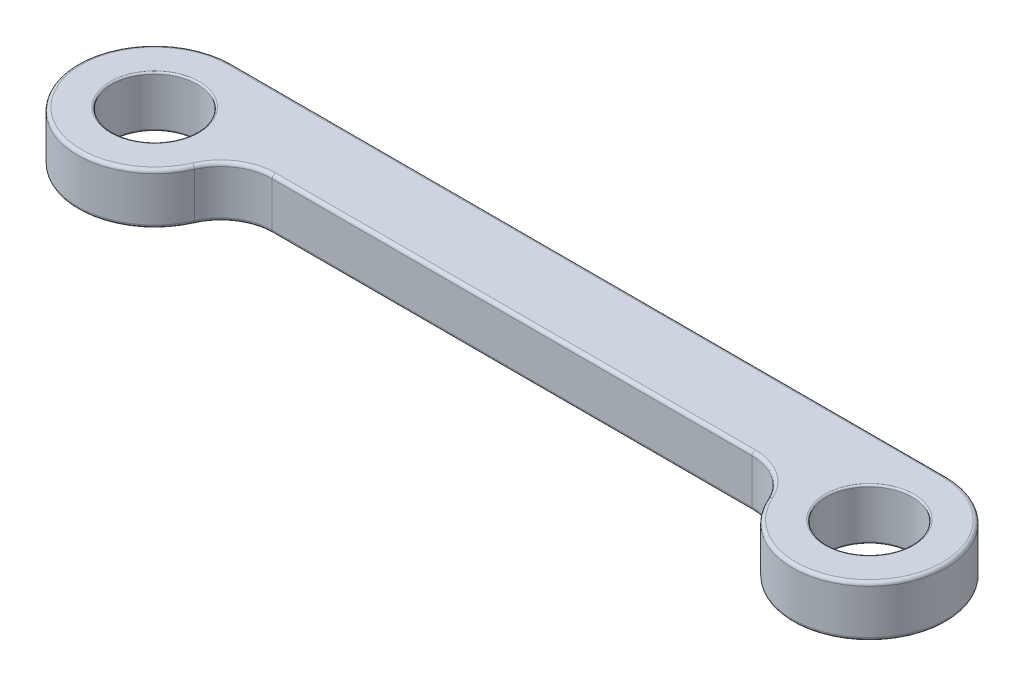
ISO-10303-21;
HEADER;
FILE_DESCRIPTION(('STEP AP214'),'2;1');
FILE_NAME('part.step','',(''),(''),'','','');
FILE_SCHEMA(('AUTOMOTIVE_DESIGN { 1 0 10303 214 1 1 1 1 }'));
ENDSEC;
DATA;
#1=APPLICATION_CONTEXT('core data for automotive mechanical design processes');
#2=APPLICATION_PROTOCOL_DEFINITION('international standard','automotive_design',2000,#1);
#3=PRODUCT_CONTEXT('',#1,'mechanical');
#4=PRODUCT('Part','Part','',(#3));
#5=PRODUCT_RELATED_PRODUCT_CATEGORY('part','',(#4));
#6=PRODUCT_DEFINITION_FORMATION('','',#4);
#7=PRODUCT_DEFINITION_CONTEXT('part definition',#1,'design');
#8=PRODUCT_DEFINITION('design','',#6,#7);
#9=PRODUCT_DEFINITION_SHAPE('','',#8);
#10=(LENGTH_UNIT() NAMED_UNIT(*) SI_UNIT(.MILLI.,.METRE.));
#11=(NAMED_UNIT(*) PLANE_ANGLE_UNIT() SI_UNIT($,.RADIAN.));
#12=(NAMED_UNIT(*) SI_UNIT($,.STERADIAN.) SOLID_ANGLE_UNIT());
#13=UNCERTAINTY_MEASURE_WITH_UNIT(LENGTH_MEASURE(1.E-05),#10,'distance_accuracy_value','');
#14=(GEOMETRIC_REPRESENTATION_CONTEXT(3) GLOBAL_UNCERTAINTY_ASSIGNED_CONTEXT((#13)) GLOBAL_UNIT_ASSIGNED_CONTEXT((#10,
#11,#12)) REPRESENTATION_CONTEXT('',''));
#15=CARTESIAN_POINT('',(0.,0.,0.));
#16=DIRECTION('',(0.,0.,1.));
#17=DIRECTION('',(1.,0.,0.));
#18=AXIS2_PLACEMENT_3D('',#15,#16,#17);
#19=CARTESIAN_POINT('',(28.0822729151325,6.,6.));
#20=DIRECTION('',(0.,1.,0.));
#21=DIRECTION('',(0.,0.,1.));
#22=AXIS2_PLACEMENT_3D('',#19,#20,#21);
#23=PLANE('',#22);
#24=CARTESIAN_POINT('',(-28.0822729151325,6.,6.));
#25=DIRECTION('',(0.,1.,0.));
#26=DIRECTION('',(0.,0.,1.));
#27=AXIS2_PLACEMENT_3D('',#24,#25,#26);
#28=CIRCLE('',#27,6.4);
#29=CARTESIAN_POINT('',(-33.9479698046759,6.,3.44));
#30=VERTEX_POINT('',#29);
#31=CARTESIAN_POINT('',(-28.0822729151325,6.,-0.4));
#32=VERTEX_POINT('',#31);
#33=EDGE_CURVE('E44',#30,#32,#28,.F.);
#34=ORIENTED_EDGE('',*,*,#33,.T.);
#35=DIRECTION('',(1.,0.,0.));
#36=VECTOR('',#35,1.);
#37=CARTESIAN_POINT('',(28.0822729151325,6.,-0.4));
#38=LINE('',#37,#36);
#39=CARTESIAN_POINT('',(28.0822729151325,6.,-0.4));
#40=VERTEX_POINT('',#39);
#41=EDGE_CURVE('E11',#32,#40,#38,.T.);
#42=ORIENTED_EDGE('',*,*,#41,.T.);
#43=CARTESIAN_POINT('',(28.0822729151325,6.,6.));
#44=DIRECTION('',(0.,1.,0.));
#45=DIRECTION('',(0.,0.,1.));
#46=AXIS2_PLACEMENT_3D('',#43,#44,#45);
#47=CIRCLE('',#46,6.4);
#48=CARTESIAN_POINT('',(33.9479698046759,6.,3.44));
#49=VERTEX_POINT('',#48);
#50=EDGE_CURVE('E199',#40,#49,#47,.F.);
#51=ORIENTED_EDGE('',*,*,#50,.T.);
#52=CARTESIAN_POINT('',(41.83,6.,0.));
#53=DIRECTION('',(0.,1.,0.));
#54=DIRECTION('',(0.,0.,1.));
#55=AXIS2_PLACEMENT_3D('',#52,#53,#54);
#56=CIRCLE('',#55,8.6);
#57=CARTESIAN_POINT('',(41.83,6.,-8.6));
#58=VERTEX_POINT('',#57);
#59=EDGE_CURVE('E201',#49,#58,#56,.T.);
#60=ORIENTED_EDGE('',*,*,#59,.T.);
#61=DIRECTION('',(-1.,0.,0.));
#62=VECTOR('',#61,1.);
#63=CARTESIAN_POINT('',(-41.83,6.,-8.6));
#64=LINE('',#63,#62);
#65=CARTESIAN_POINT('',(-41.83,6.,-8.6));
#66=VERTEX_POINT('',#65);
#67=EDGE_CURVE('E152',#58,#66,#64,.T.);
#68=ORIENTED_EDGE('',*,*,#67,.T.);
#69=CARTESIAN_POINT('',(-41.83,6.,0.));
#70=DIRECTION('',(0.,1.,0.));
#71=DIRECTION('',(0.,0.,1.));
#72=AXIS2_PLACEMENT_3D('',#69,#70,#71);
#73=CIRCLE('',#72,8.6);
#74=EDGE_CURVE('E55',#66,#30,#73,.T.);
#75=ORIENTED_EDGE('',*,*,#74,.T.);
#76=EDGE_LOOP('',(#34,#42,#51,#60,#68,#75));
#77=FACE_BOUND('',#76,.T.);
#78=CARTESIAN_POINT('',(-41.83,6.,0.));
#79=DIRECTION('',(0.,1.,0.));
#80=DIRECTION('',(0.,0.,1.));
#81=AXIS2_PLACEMENT_3D('',#78,#79,#80);
#82=CIRCLE('',#81,5.2);
#83=CARTESIAN_POINT('',(-41.83,6.,5.2));
#84=VERTEX_POINT('',#83);
#85=EDGE_CURVE('E260',#84,#84,#82,.F.);
#86=ORIENTED_EDGE('',*,*,#85,.T.);
#87=EDGE_LOOP('',(#86));
#88=FACE_BOUND('',#87,.T.);
#89=CARTESIAN_POINT('',(41.83,6.,0.));
#90=DIRECTION('',(0.,1.,0.));
#91=DIRECTION('',(0.,0.,1.));
#92=AXIS2_PLACEMENT_3D('',#89,#90,#91);
#93=CIRCLE('',#92,5.2);
#94=CARTESIAN_POINT('',(41.83,6.,5.2));
#95=VERTEX_POINT('',#94);
#96=EDGE_CURVE('E257',#95,#95,#93,.F.);
#97=ORIENTED_EDGE('',*,*,#96,.T.);
#98=EDGE_LOOP('',(#97));
#99=FACE_BOUND('',#98,.T.);
#100=ADVANCED_FACE('F35',(#77,#88,#99),#23,.T.);
#101=CARTESIAN_POINT('',(28.0822729151325,0.,6.));
#102=DIRECTION('',(0.,1.,0.));
#103=DIRECTION('',(0.,0.,1.));
#104=AXIS2_PLACEMENT_3D('',#101,#102,#103);
#105=PLANE('',#104);
#106=DIRECTION('',(-1.,0.,0.));
#107=VECTOR('',#106,1.);
#108=CARTESIAN_POINT('',(28.0822729151325,0.,-8.6));
#109=LINE('',#108,#107);
#110=CARTESIAN_POINT('',(-41.83,0.,-8.6));
#111=VERTEX_POINT('',#110);
#112=CARTESIAN_POINT('',(41.83,0.,-8.6));
#113=VERTEX_POINT('',#112);
#114=EDGE_CURVE('E177',#111,#113,#109,.F.);
#115=ORIENTED_EDGE('',*,*,#114,.T.);
#116=CARTESIAN_POINT('',(41.83,0.,0.));
#117=DIRECTION('',(0.,1.,0.));
#118=DIRECTION('',(0.,0.,1.));
#119=AXIS2_PLACEMENT_3D('',#116,#117,#118);
#120=CIRCLE('',#119,8.6);
#121=CARTESIAN_POINT('',(33.9479698046759,0.,3.44));
#122=VERTEX_POINT('',#121);
#123=EDGE_CURVE('E136',#113,#122,#120,.F.);
#124=ORIENTED_EDGE('',*,*,#123,.T.);
#125=CARTESIAN_POINT('',(28.0822729151325,0.,6.));
#126=DIRECTION('',(0.,1.,0.));
#127=DIRECTION('',(0.,0.,1.));
#128=AXIS2_PLACEMENT_3D('',#125,#126,#127);
#129=CIRCLE('',#128,6.4);
#130=CARTESIAN_POINT('',(28.0822729151325,0.,-0.4));
#131=VERTEX_POINT('',#130);
#132=EDGE_CURVE('E163',#122,#131,#129,.T.);
#133=ORIENTED_EDGE('',*,*,#132,.T.);
#134=DIRECTION('',(1.,0.,0.));
#135=VECTOR('',#134,1.);
#136=CARTESIAN_POINT('',(28.0822729151325,0.,-0.4));
#137=LINE('',#136,#135);
#138=CARTESIAN_POINT('',(-28.0822729151325,0.,-0.4));
#139=VERTEX_POINT('',#138);
#140=EDGE_CURVE('E171',#131,#139,#137,.F.);
#141=ORIENTED_EDGE('',*,*,#140,.T.);
#142=CARTESIAN_POINT('',(-28.0822729151325,0.,6.));
#143=DIRECTION('',(0.,1.,0.));
#144=DIRECTION('',(0.,0.,1.));
#145=AXIS2_PLACEMENT_3D('',#142,#143,#144);
#146=CIRCLE('',#145,6.4);
#147=CARTESIAN_POINT('',(-33.9479698046759,0.,3.44));
#148=VERTEX_POINT('',#147);
#149=EDGE_CURVE('E173',#139,#148,#146,.T.);
#150=ORIENTED_EDGE('',*,*,#149,.T.);
#151=CARTESIAN_POINT('',(-41.83,0.,0.));
#152=DIRECTION('',(0.,1.,0.));
#153=DIRECTION('',(0.,0.,1.));
#154=AXIS2_PLACEMENT_3D('',#151,#152,#153);
#155=CIRCLE('',#154,8.6);
#156=EDGE_CURVE('E175',#148,#111,#155,.F.);
#157=ORIENTED_EDGE('',*,*,#156,.T.);
#158=EDGE_LOOP('',(#115,#124,#133,#141,#150,#157));
#159=FACE_BOUND('',#158,.T.);
#160=CARTESIAN_POINT('',(-41.83,0.,0.));
#161=DIRECTION('',(0.,1.,0.));
#162=DIRECTION('',(0.,0.,1.));
#163=AXIS2_PLACEMENT_3D('',#160,#161,#162);
#164=CIRCLE('',#163,5.2);
#165=CARTESIAN_POINT('',(-41.83,0.,5.2));
#166=VERTEX_POINT('',#165);
#167=EDGE_CURVE('E161',#166,#166,#164,.T.);
#168=ORIENTED_EDGE('',*,*,#167,.T.);
#169=EDGE_LOOP('',(#168));
#170=FACE_BOUND('',#169,.T.);
#171=CARTESIAN_POINT('',(41.83,0.,0.));
#172=DIRECTION('',(0.,1.,0.));
#173=DIRECTION('',(0.,0.,1.));
#174=AXIS2_PLACEMENT_3D('',#171,#172,#173);
#175=CIRCLE('',#174,5.2);
#176=CARTESIAN_POINT('',(41.83,0.,5.2));
#177=VERTEX_POINT('',#176);
#178=EDGE_CURVE('E166',#177,#177,#175,.T.);
#179=ORIENTED_EDGE('',*,*,#178,.T.);
#180=EDGE_LOOP('',(#179));
#181=FACE_BOUND('',#180,.T.);
#182=ADVANCED_FACE('F271',(#159,#170,#181),#105,.F.);
#183=CARTESIAN_POINT('',(28.0822729151325,6.,6.));
#184=DIRECTION('',(0.,-1.,0.));
#185=DIRECTION('',(0.,0.,-1.));
#186=AXIS2_PLACEMENT_3D('',#183,#184,#185);
#187=CYLINDRICAL_SURFACE('',#186,6.);
#188=DIRECTION('',(0.,-1.,0.));
#189=VECTOR('',#188,1.);
#190=CARTESIAN_POINT('',(28.0822729151325,6.,0.));
#191=LINE('',#190,#189);
#192=CARTESIAN_POINT('',(28.0822729151325,5.6,0.));
#193=VERTEX_POINT('',#192);
#194=CARTESIAN_POINT('',(28.0822729151325,0.4,0.));
#195=VERTEX_POINT('',#194);
#196=EDGE_CURVE('E222',#193,#195,#191,.T.);
#197=ORIENTED_EDGE('',*,*,#196,.T.);
#198=CARTESIAN_POINT('',(28.0822729151325,0.4,6.));
#199=DIRECTION('',(0.,1.,0.));
#200=DIRECTION('',(0.,0.,1.));
#201=AXIS2_PLACEMENT_3D('',#198,#199,#200);
#202=CIRCLE('',#201,6.);
#203=CARTESIAN_POINT('',(33.5813637490795,0.4,3.6));
#204=VERTEX_POINT('',#203);
#205=EDGE_CURVE('E197',#195,#204,#202,.F.);
#206=ORIENTED_EDGE('',*,*,#205,.T.);
#207=DIRECTION('',(0.,-1.,0.));
#208=VECTOR('',#207,1.);
#209=CARTESIAN_POINT('',(33.5813637490795,6.,3.6));
#210=LINE('',#209,#208);
#211=CARTESIAN_POINT('',(33.5813637490795,5.6,3.6));
#212=VERTEX_POINT('',#211);
#213=EDGE_CURVE('E147',#212,#204,#210,.T.);
#214=ORIENTED_EDGE('',*,*,#213,.F.);
#215=CARTESIAN_POINT('',(28.0822729151325,5.6,6.));
#216=DIRECTION('',(0.,1.,0.));
#217=DIRECTION('',(0.,0.,1.));
#218=AXIS2_PLACEMENT_3D('',#215,#216,#217);
#219=CIRCLE('',#218,6.);
#220=EDGE_CURVE('E195',#212,#193,#219,.T.);
#221=ORIENTED_EDGE('',*,*,#220,.T.);
#222=EDGE_LOOP('',(#197,#206,#214,#221));
#223=FACE_BOUND('',#222,.T.);
#224=ADVANCED_FACE('F296',(#223),#187,.F.);
#225=CARTESIAN_POINT('',(41.83,6.,0.));
#226=DIRECTION('',(0.,-1.,0.));
#227=DIRECTION('',(0.,0.,-1.));
#228=AXIS2_PLACEMENT_3D('',#225,#226,#227);
#229=CYLINDRICAL_SURFACE('',#228,9.);
#230=ORIENTED_EDGE('',*,*,#213,.T.);
#231=CARTESIAN_POINT('',(41.83,0.4,0.));
#232=DIRECTION('',(0.,1.,0.));
#233=DIRECTION('',(0.,0.,1.));
#234=AXIS2_PLACEMENT_3D('',#231,#232,#233);
#235=CIRCLE('',#234,9.);
#236=CARTESIAN_POINT('',(41.83,0.4,-9.));
#237=VERTEX_POINT('',#236);
#238=EDGE_CURVE('E146',#204,#237,#235,.T.);
#239=ORIENTED_EDGE('',*,*,#238,.T.);
#240=DIRECTION('',(0.,-1.,0.));
#241=VECTOR('',#240,1.);
#242=CARTESIAN_POINT('',(41.83,6.,-9.));
#243=LINE('',#242,#241);
#244=CARTESIAN_POINT('',(41.83,5.6,-9.));
#245=VERTEX_POINT('',#244);
#246=EDGE_CURVE('E128',#245,#237,#243,.T.);
#247=ORIENTED_EDGE('',*,*,#246,.F.);
#248=CARTESIAN_POINT('',(41.83,5.6,0.));
#249=DIRECTION('',(0.,1.,0.));
#250=DIRECTION('',(0.,0.,1.));
#251=AXIS2_PLACEMENT_3D('',#248,#249,#250);
#252=CIRCLE('',#251,9.);
#253=EDGE_CURVE('E143',#245,#212,#252,.F.);
#254=ORIENTED_EDGE('',*,*,#253,.T.);
#255=EDGE_LOOP('',(#230,#239,#247,#254));
#256=FACE_BOUND('',#255,.T.);
#257=ADVANCED_FACE('F141',(#256),#229,.T.);
#258=CARTESIAN_POINT('',(-41.83,6.,-9.));
#259=DIRECTION('',(0.,0.,1.));
#260=DIRECTION('',(1.,0.,0.));
#261=AXIS2_PLACEMENT_3D('',#258,#259,#260);
#262=PLANE('',#261);
#263=ORIENTED_EDGE('',*,*,#246,.T.);
#264=DIRECTION('',(-1.,0.,0.));
#265=VECTOR('',#264,1.);
#266=CARTESIAN_POINT('',(-41.83,0.4,-9.));
#267=LINE('',#266,#265);
#268=CARTESIAN_POINT('',(-41.83,0.4,-9.));
#269=VERTEX_POINT('',#268);
#270=EDGE_CURVE('E135',#237,#269,#267,.T.);
#271=ORIENTED_EDGE('',*,*,#270,.T.);
#272=DIRECTION('',(0.,-1.,0.));
#273=VECTOR('',#272,1.);
#274=CARTESIAN_POINT('',(-41.83,6.,-9.));
#275=LINE('',#274,#273);
#276=CARTESIAN_POINT('',(-41.83,5.6,-9.));
#277=VERTEX_POINT('',#276);
#278=EDGE_CURVE('E130',#277,#269,#275,.T.);
#279=ORIENTED_EDGE('',*,*,#278,.F.);
#280=DIRECTION('',(-1.,0.,0.));
#281=VECTOR('',#280,1.);
#282=CARTESIAN_POINT('',(41.83,5.6,-9.));
#283=LINE('',#282,#281);
#284=EDGE_CURVE('E125',#277,#245,#283,.F.);
#285=ORIENTED_EDGE('',*,*,#284,.T.);
#286=EDGE_LOOP('',(#263,#271,#279,#285));
#287=FACE_BOUND('',#286,.T.);
#288=ADVANCED_FACE('F127',(#287),#262,.F.);
#289=CARTESIAN_POINT('',(-41.83,6.,0.));
#290=DIRECTION('',(0.,-1.,0.));
#291=DIRECTION('',(0.,0.,-1.));
#292=AXIS2_PLACEMENT_3D('',#289,#290,#291);
#293=CYLINDRICAL_SURFACE('',#292,9.);
#294=ORIENTED_EDGE('',*,*,#278,.T.);
#295=CARTESIAN_POINT('',(-41.83,0.4,0.));
#296=DIRECTION('',(0.,1.,0.));
#297=DIRECTION('',(0.,0.,1.));
#298=AXIS2_PLACEMENT_3D('',#295,#296,#297);
#299=CIRCLE('',#298,9.);
#300=CARTESIAN_POINT('',(-33.5813637490795,0.4,3.6));
#301=VERTEX_POINT('',#300);
#302=EDGE_CURVE('E184',#269,#301,#299,.T.);
#303=ORIENTED_EDGE('',*,*,#302,.T.);
#304=DIRECTION('',(0.,-1.,0.));
#305=VECTOR('',#304,1.);
#306=CARTESIAN_POINT('',(-33.5813637490795,6.,3.6));
#307=LINE('',#306,#305);
#308=CARTESIAN_POINT('',(-33.5813637490795,5.6,3.6));
#309=VERTEX_POINT('',#308);
#310=EDGE_CURVE('E240',#309,#301,#307,.T.);
#311=ORIENTED_EDGE('',*,*,#310,.F.);
#312=CARTESIAN_POINT('',(-41.83,5.6,0.));
#313=DIRECTION('',(0.,1.,0.));
#314=DIRECTION('',(0.,0.,1.));
#315=AXIS2_PLACEMENT_3D('',#312,#313,#314);
#316=CIRCLE('',#315,9.);
#317=EDGE_CURVE('E182',#309,#277,#316,.F.);
#318=ORIENTED_EDGE('',*,*,#317,.T.);
#319=EDGE_LOOP('',(#294,#303,#311,#318));
#320=FACE_BOUND('',#319,.T.);
#321=ADVANCED_FACE('F237',(#320),#293,.T.);
#322=CARTESIAN_POINT('',(-28.0822729151325,6.,6.));
#323=DIRECTION('',(0.,-1.,0.));
#324=DIRECTION('',(0.,0.,-1.));
#325=AXIS2_PLACEMENT_3D('',#322,#323,#324);
#326=CYLINDRICAL_SURFACE('',#325,6.);
#327=ORIENTED_EDGE('',*,*,#310,.T.);
#328=CARTESIAN_POINT('',(-28.0822729151325,0.4,6.));
#329=DIRECTION('',(0.,1.,0.));
#330=DIRECTION('',(0.,0.,1.));
#331=AXIS2_PLACEMENT_3D('',#328,#329,#330);
#332=CIRCLE('',#331,6.);
#333=CARTESIAN_POINT('',(-28.0822729151325,0.4,0.));
#334=VERTEX_POINT('',#333);
#335=EDGE_CURVE('E188',#301,#334,#332,.F.);
#336=ORIENTED_EDGE('',*,*,#335,.T.);
#337=DIRECTION('',(0.,-1.,0.));
#338=VECTOR('',#337,1.);
#339=CARTESIAN_POINT('',(-28.0822729151325,6.,0.));
#340=LINE('',#339,#338);
#341=CARTESIAN_POINT('',(-28.0822729151325,5.6,0.));
#342=VERTEX_POINT('',#341);
#343=EDGE_CURVE('E243',#342,#334,#340,.T.);
#344=ORIENTED_EDGE('',*,*,#343,.F.);
#345=CARTESIAN_POINT('',(-28.0822729151325,5.6,6.));
#346=DIRECTION('',(0.,1.,0.));
#347=DIRECTION('',(0.,0.,1.));
#348=AXIS2_PLACEMENT_3D('',#345,#346,#347);
#349=CIRCLE('',#348,6.);
#350=EDGE_CURVE('E186',#342,#309,#349,.T.);
#351=ORIENTED_EDGE('',*,*,#350,.T.);
#352=EDGE_LOOP('',(#327,#336,#344,#351));
#353=FACE_BOUND('',#352,.T.);
#354=ADVANCED_FACE('F307',(#353),#326,.F.);
#355=CARTESIAN_POINT('',(-28.0822729151325,6.,0.));
#356=DIRECTION('',(0.,0.,-1.));
#357=DIRECTION('',(-1.,0.,0.));
#358=AXIS2_PLACEMENT_3D('',#355,#356,#357);
#359=PLANE('',#358);
#360=ORIENTED_EDGE('',*,*,#343,.T.);
#361=DIRECTION('',(1.,0.,0.));
#362=VECTOR('',#361,1.);
#363=CARTESIAN_POINT('',(-28.0822729151325,0.4,0.));
#364=LINE('',#363,#362);
#365=EDGE_CURVE('E193',#334,#195,#364,.T.);
#366=ORIENTED_EDGE('',*,*,#365,.T.);
#367=ORIENTED_EDGE('',*,*,#196,.F.);
#368=DIRECTION('',(1.,0.,0.));
#369=VECTOR('',#368,1.);
#370=CARTESIAN_POINT('',(-28.0822729151325,5.6,0.));
#371=LINE('',#370,#369);
#372=EDGE_CURVE('E190',#193,#342,#371,.F.);
#373=ORIENTED_EDGE('',*,*,#372,.T.);
#374=EDGE_LOOP('',(#360,#366,#367,#373));
#375=FACE_BOUND('',#374,.T.);
#376=ADVANCED_FACE('F304',(#375),#359,.F.);
#377=CARTESIAN_POINT('',(-41.83,6.,0.));
#378=DIRECTION('',(0.,-1.,0.));
#379=DIRECTION('',(0.,0.,-1.));
#380=AXIS2_PLACEMENT_3D('',#377,#378,#379);
#381=CYLINDRICAL_SURFACE('',#380,5.);
#382=CARTESIAN_POINT('',(-41.83,5.8,0.));
#383=DIRECTION('',(0.,1.,0.));
#384=DIRECTION('',(0.,0.,1.));
#385=AXIS2_PLACEMENT_3D('',#382,#383,#384);
#386=CIRCLE('',#385,5.);
#387=CARTESIAN_POINT('',(-41.83,5.8,5.));
#388=VERTEX_POINT('',#387);
#389=EDGE_CURVE('E254',#388,#388,#386,.T.);
#390=ORIENTED_EDGE('',*,*,#389,.T.);
#391=EDGE_LOOP('',(#390));
#392=FACE_BOUND('',#391,.T.);
#393=CARTESIAN_POINT('',(-41.83,0.2,0.));
#394=DIRECTION('',(0.,1.,0.));
#395=DIRECTION('',(0.,0.,1.));
#396=AXIS2_PLACEMENT_3D('',#393,#394,#395);
#397=CIRCLE('',#396,5.);
#398=CARTESIAN_POINT('',(-41.83,0.2,5.));
#399=VERTEX_POINT('',#398);
#400=EDGE_CURVE('E251',#399,#399,#397,.F.);
#401=ORIENTED_EDGE('',*,*,#400,.T.);
#402=EDGE_LOOP('',(#401));
#403=FACE_BOUND('',#402,.T.);
#404=ADVANCED_FACE('F301',(#392,#403),#381,.F.);
#405=CARTESIAN_POINT('',(41.83,6.,0.));
#406=DIRECTION('',(0.,-1.,0.));
#407=DIRECTION('',(0.,0.,-1.));
#408=AXIS2_PLACEMENT_3D('',#405,#406,#407);
#409=CYLINDRICAL_SURFACE('',#408,5.);
#410=CARTESIAN_POINT('',(41.83,5.8,0.));
#411=DIRECTION('',(0.,1.,0.));
#412=DIRECTION('',(0.,0.,1.));
#413=AXIS2_PLACEMENT_3D('',#410,#411,#412);
#414=CIRCLE('',#413,5.);
#415=CARTESIAN_POINT('',(41.83,5.8,5.));
#416=VERTEX_POINT('',#415);
#417=EDGE_CURVE('E266',#416,#416,#414,.T.);
#418=ORIENTED_EDGE('',*,*,#417,.T.);
#419=EDGE_LOOP('',(#418));
#420=FACE_BOUND('',#419,.T.);
#421=CARTESIAN_POINT('',(41.83,0.2,0.));
#422=DIRECTION('',(0.,1.,0.));
#423=DIRECTION('',(0.,0.,1.));
#424=AXIS2_PLACEMENT_3D('',#421,#422,#423);
#425=CIRCLE('',#424,5.);
#426=CARTESIAN_POINT('',(41.83,0.2,5.));
#427=VERTEX_POINT('',#426);
#428=EDGE_CURVE('E263',#427,#427,#425,.F.);
#429=ORIENTED_EDGE('',*,*,#428,.T.);
#430=EDGE_LOOP('',(#429));
#431=FACE_BOUND('',#430,.T.);
#432=ADVANCED_FACE('F323',(#420,#431),#409,.F.);
#433=CARTESIAN_POINT('',(-41.83,5.8,0.));
#434=DIRECTION('',(0.,1.,0.));
#435=DIRECTION('',(0.,0.,1.));
#436=AXIS2_PLACEMENT_3D('',#433,#434,#435);
#437=TOROIDAL_SURFACE('',#436,5.2,0.2);
#438=ORIENTED_EDGE('',*,*,#85,.F.);
#439=EDGE_LOOP('',(#438));
#440=FACE_BOUND('',#439,.T.);
#441=ORIENTED_EDGE('',*,*,#389,.F.);
#442=EDGE_LOOP('',(#441));
#443=FACE_BOUND('',#442,.T.);
#444=ADVANCED_FACE('F320',(#440,#443),#437,.T.);
#445=CARTESIAN_POINT('',(41.83,5.8,0.));
#446=DIRECTION('',(0.,1.,0.));
#447=DIRECTION('',(0.,0.,1.));
#448=AXIS2_PLACEMENT_3D('',#445,#446,#447);
#449=TOROIDAL_SURFACE('',#448,5.2,0.2);
#450=ORIENTED_EDGE('',*,*,#96,.F.);
#451=EDGE_LOOP('',(#450));
#452=FACE_BOUND('',#451,.T.);
#453=ORIENTED_EDGE('',*,*,#417,.F.);
#454=EDGE_LOOP('',(#453));
#455=FACE_BOUND('',#454,.T.);
#456=ADVANCED_FACE('F286',(#452,#455),#449,.T.);
#457=CARTESIAN_POINT('',(-41.83,0.2,0.));
#458=DIRECTION('',(0.,1.,0.));
#459=DIRECTION('',(0.,0.,1.));
#460=AXIS2_PLACEMENT_3D('',#457,#458,#459);
#461=TOROIDAL_SURFACE('',#460,5.2,0.2);
#462=ORIENTED_EDGE('',*,*,#400,.F.);
#463=EDGE_LOOP('',(#462));
#464=FACE_BOUND('',#463,.T.);
#465=ORIENTED_EDGE('',*,*,#167,.F.);
#466=EDGE_LOOP('',(#465));
#467=FACE_BOUND('',#466,.T.);
#468=ADVANCED_FACE('F276',(#464,#467),#461,.T.);
#469=CARTESIAN_POINT('',(41.83,0.2,0.));
#470=DIRECTION('',(0.,1.,0.));
#471=DIRECTION('',(0.,0.,1.));
#472=AXIS2_PLACEMENT_3D('',#469,#470,#471);
#473=TOROIDAL_SURFACE('',#472,5.2,0.2);
#474=ORIENTED_EDGE('',*,*,#428,.F.);
#475=EDGE_LOOP('',(#474));
#476=FACE_BOUND('',#475,.T.);
#477=ORIENTED_EDGE('',*,*,#178,.F.);
#478=EDGE_LOOP('',(#477));
#479=FACE_BOUND('',#478,.T.);
#480=ADVANCED_FACE('F273',(#476,#479),#473,.T.);
#481=CARTESIAN_POINT('',(-28.0822729151325,0.4,6.));
#482=DIRECTION('',(0.,1.,0.));
#483=DIRECTION('',(0.,0.,1.));
#484=AXIS2_PLACEMENT_3D('',#481,#482,#483);
#485=TOROIDAL_SURFACE('',#484,6.4,0.4);
#486=CARTESIAN_POINT('',(-33.9479698046759,0.4,3.44));
#487=DIRECTION('',(-0.399999999999997,0.,0.916515138991169));
#488=DIRECTION('',(0.916515138991169,0.,0.399999999999997));
#489=AXIS2_PLACEMENT_3D('',#486,#487,#488);
#490=CIRCLE('',#489,0.4);
#491=EDGE_CURVE('E216',#148,#301,#490,.T.);
#492=ORIENTED_EDGE('',*,*,#491,.F.);
#493=ORIENTED_EDGE('',*,*,#149,.F.);
#494=CARTESIAN_POINT('',(-28.0822729151325,0.4,-0.4));
#495=DIRECTION('',(1.,0.,0.));
#496=DIRECTION('',(0.,0.,-1.));
#497=AXIS2_PLACEMENT_3D('',#494,#495,#496);
#498=CIRCLE('',#497,0.4);
#499=EDGE_CURVE('E219',#334,#139,#498,.T.);
#500=ORIENTED_EDGE('',*,*,#499,.F.);
#501=ORIENTED_EDGE('',*,*,#335,.F.);
#502=EDGE_LOOP('',(#492,#493,#500,#501));
#503=FACE_BOUND('',#502,.T.);
#504=ADVANCED_FACE('F275',(#503),#485,.T.);
#505=CARTESIAN_POINT('',(-28.0822729151325,0.4,-0.4));
#506=DIRECTION('',(1.,0.,0.));
#507=DIRECTION('',(0.,0.,-1.));
#508=AXIS2_PLACEMENT_3D('',#505,#506,#507);
#509=CYLINDRICAL_SURFACE('',#508,0.4);
#510=ORIENTED_EDGE('',*,*,#499,.T.);
#511=ORIENTED_EDGE('',*,*,#140,.F.);
#512=CARTESIAN_POINT('',(28.0822729151325,0.4,-0.4));
#513=DIRECTION('',(1.,0.,0.));
#514=DIRECTION('',(0.,0.,-1.));
#515=AXIS2_PLACEMENT_3D('',#512,#513,#514);
#516=CIRCLE('',#515,0.4);
#517=EDGE_CURVE('E213',#195,#131,#516,.T.);
#518=ORIENTED_EDGE('',*,*,#517,.F.);
#519=ORIENTED_EDGE('',*,*,#365,.F.);
#520=EDGE_LOOP('',(#510,#511,#518,#519));
#521=FACE_BOUND('',#520,.T.);
#522=ADVANCED_FACE('F283',(#521),#509,.T.);
#523=CARTESIAN_POINT('',(-41.83,0.4,0.));
#524=DIRECTION('',(0.,1.,0.));
#525=DIRECTION('',(0.,0.,1.));
#526=AXIS2_PLACEMENT_3D('',#523,#524,#525);
#527=TOROIDAL_SURFACE('',#526,8.6,0.4);
#528=ORIENTED_EDGE('',*,*,#491,.T.);
#529=ORIENTED_EDGE('',*,*,#302,.F.);
#530=CARTESIAN_POINT('',(-41.83,0.4,-8.6));
#531=DIRECTION('',(1.,0.,0.));
#532=DIRECTION('',(0.,0.,-1.));
#533=AXIS2_PLACEMENT_3D('',#530,#531,#532);
#534=CIRCLE('',#533,0.4);
#535=EDGE_CURVE('E210',#111,#269,#534,.T.);
#536=ORIENTED_EDGE('',*,*,#535,.F.);
#537=ORIENTED_EDGE('',*,*,#156,.F.);
#538=EDGE_LOOP('',(#528,#529,#536,#537));
#539=FACE_BOUND('',#538,.T.);
#540=ADVANCED_FACE('F408',(#539),#527,.T.);
#541=CARTESIAN_POINT('',(28.0822729151325,0.4,6.));
#542=DIRECTION('',(0.,1.,0.));
#543=DIRECTION('',(0.,0.,1.));
#544=AXIS2_PLACEMENT_3D('',#541,#542,#543);
#545=TOROIDAL_SURFACE('',#544,6.4,0.4);
#546=ORIENTED_EDGE('',*,*,#517,.T.);
#547=ORIENTED_EDGE('',*,*,#132,.F.);
#548=CARTESIAN_POINT('',(33.9479698046759,0.4,3.44));
#549=DIRECTION('',(0.399999999999997,0.,0.916515138991169));
#550=DIRECTION('',(0.916515138991169,0.,-0.399999999999997));
#551=AXIS2_PLACEMENT_3D('',#548,#549,#550);
#552=CIRCLE('',#551,0.4);
#553=EDGE_CURVE('E208',#204,#122,#552,.T.);
#554=ORIENTED_EDGE('',*,*,#553,.F.);
#555=ORIENTED_EDGE('',*,*,#205,.F.);
#556=EDGE_LOOP('',(#546,#547,#554,#555));
#557=FACE_BOUND('',#556,.T.);
#558=ADVANCED_FACE('F418',(#557),#545,.T.);
#559=CARTESIAN_POINT('',(-41.83,0.4,-8.6));
#560=DIRECTION('',(-1.,0.,0.));
#561=DIRECTION('',(0.,0.,1.));
#562=AXIS2_PLACEMENT_3D('',#559,#560,#561);
#563=CYLINDRICAL_SURFACE('',#562,0.4);
#564=ORIENTED_EDGE('',*,*,#535,.T.);
#565=ORIENTED_EDGE('',*,*,#270,.F.);
#566=CARTESIAN_POINT('',(41.83,0.4,-8.6));
#567=DIRECTION('',(1.,0.,0.));
#568=DIRECTION('',(0.,0.,-1.));
#569=AXIS2_PLACEMENT_3D('',#566,#567,#568);
#570=CIRCLE('',#569,0.4);
#571=EDGE_CURVE('E206',#113,#237,#570,.T.);
#572=ORIENTED_EDGE('',*,*,#571,.F.);
#573=ORIENTED_EDGE('',*,*,#114,.F.);
#574=EDGE_LOOP('',(#564,#565,#572,#573));
#575=FACE_BOUND('',#574,.T.);
#576=ADVANCED_FACE('F428',(#575),#563,.T.);
#577=CARTESIAN_POINT('',(41.83,0.4,0.));
#578=DIRECTION('',(0.,1.,0.));
#579=DIRECTION('',(0.,0.,1.));
#580=AXIS2_PLACEMENT_3D('',#577,#578,#579);
#581=TOROIDAL_SURFACE('',#580,8.6,0.4);
#582=ORIENTED_EDGE('',*,*,#553,.T.);
#583=ORIENTED_EDGE('',*,*,#123,.F.);
#584=ORIENTED_EDGE('',*,*,#571,.T.);
#585=ORIENTED_EDGE('',*,*,#238,.F.);
#586=EDGE_LOOP('',(#582,#583,#584,#585));
#587=FACE_BOUND('',#586,.T.);
#588=ADVANCED_FACE('F438',(#587),#581,.T.);
#589=CARTESIAN_POINT('',(28.0822729151325,5.6,-8.6));
#590=DIRECTION('',(1.,0.,0.));
#591=DIRECTION('',(0.,0.,-1.));
#592=AXIS2_PLACEMENT_3D('',#589,#590,#591);
#593=CYLINDRICAL_SURFACE('',#592,0.4);
#594=CARTESIAN_POINT('',(41.83,5.6,-8.6));
#595=DIRECTION('',(1.,0.,0.));
#596=DIRECTION('',(0.,0.,-1.));
#597=AXIS2_PLACEMENT_3D('',#594,#595,#596);
#598=CIRCLE('',#597,0.4);
#599=EDGE_CURVE('E151',#245,#58,#598,.T.);
#600=ORIENTED_EDGE('',*,*,#599,.F.);
#601=ORIENTED_EDGE('',*,*,#284,.F.);
#602=CARTESIAN_POINT('',(-41.83,5.6,-8.6));
#603=DIRECTION('',(-1.,0.,0.));
#604=DIRECTION('',(0.,0.,1.));
#605=AXIS2_PLACEMENT_3D('',#602,#603,#604);
#606=CIRCLE('',#605,0.4);
#607=EDGE_CURVE('E39',#66,#277,#606,.T.);
#608=ORIENTED_EDGE('',*,*,#607,.F.);
#609=ORIENTED_EDGE('',*,*,#67,.F.);
#610=EDGE_LOOP('',(#600,#601,#608,#609));
#611=FACE_BOUND('',#610,.T.);
#612=ADVANCED_FACE('F37',(#611),#593,.T.);
#613=CARTESIAN_POINT('',(-41.83,5.6,0.));
#614=DIRECTION('',(0.,1.,0.));
#615=DIRECTION('',(0.,0.,1.));
#616=AXIS2_PLACEMENT_3D('',#613,#614,#615);
#617=TOROIDAL_SURFACE('',#616,8.6,0.4);
#618=ORIENTED_EDGE('',*,*,#607,.T.);
#619=ORIENTED_EDGE('',*,*,#317,.F.);
#620=CARTESIAN_POINT('',(-33.9479698046759,5.6,3.44));
#621=DIRECTION('',(0.399999999999993,0.,-0.916515138991171));
#622=DIRECTION('',(-0.916515138991171,0.,-0.399999999999993));
#623=AXIS2_PLACEMENT_3D('',#620,#621,#622);
#624=CIRCLE('',#623,0.4);
#625=EDGE_CURVE('E155',#30,#309,#624,.T.);
#626=ORIENTED_EDGE('',*,*,#625,.F.);
#627=ORIENTED_EDGE('',*,*,#74,.F.);
#628=EDGE_LOOP('',(#618,#619,#626,#627));
#629=FACE_BOUND('',#628,.T.);
#630=ADVANCED_FACE('F234',(#629),#617,.T.);
#631=CARTESIAN_POINT('',(41.83,5.6,0.));
#632=DIRECTION('',(0.,1.,0.));
#633=DIRECTION('',(0.,0.,1.));
#634=AXIS2_PLACEMENT_3D('',#631,#632,#633);
#635=TOROIDAL_SURFACE('',#634,8.6,0.4);
#636=ORIENTED_EDGE('',*,*,#599,.T.);
#637=ORIENTED_EDGE('',*,*,#59,.F.);
#638=CARTESIAN_POINT('',(33.9479698046759,5.6,3.44));
#639=DIRECTION('',(-0.399999999999997,0.,-0.916515138991169));
#640=DIRECTION('',(-0.916515138991169,0.,0.399999999999997));
#641=AXIS2_PLACEMENT_3D('',#638,#639,#640);
#642=CIRCLE('',#641,0.4);
#643=EDGE_CURVE('E159',#212,#49,#642,.T.);
#644=ORIENTED_EDGE('',*,*,#643,.F.);
#645=ORIENTED_EDGE('',*,*,#253,.F.);
#646=EDGE_LOOP('',(#636,#637,#644,#645));
#647=FACE_BOUND('',#646,.T.);
#648=ADVANCED_FACE('F157',(#647),#635,.T.);
#649=CARTESIAN_POINT('',(-28.0822729151325,5.6,6.));
#650=DIRECTION('',(0.,1.,0.));
#651=DIRECTION('',(0.,0.,1.));
#652=AXIS2_PLACEMENT_3D('',#649,#650,#651);
#653=TOROIDAL_SURFACE('',#652,6.4,0.4);
#654=ORIENTED_EDGE('',*,*,#625,.T.);
#655=ORIENTED_EDGE('',*,*,#350,.F.);
#656=CARTESIAN_POINT('',(-28.0822729151325,5.6,-0.4));
#657=DIRECTION('',(1.,0.,0.));
#658=DIRECTION('',(0.,0.,-1.));
#659=AXIS2_PLACEMENT_3D('',#656,#657,#658);
#660=CIRCLE('',#659,0.4);
#661=EDGE_CURVE('E225',#32,#342,#660,.T.);
#662=ORIENTED_EDGE('',*,*,#661,.F.);
#663=ORIENTED_EDGE('',*,*,#33,.F.);
#664=EDGE_LOOP('',(#654,#655,#662,#663));
#665=FACE_BOUND('',#664,.T.);
#666=ADVANCED_FACE('F231',(#665),#653,.T.);
#667=CARTESIAN_POINT('',(28.0822729151325,5.6,6.));
#668=DIRECTION('',(0.,1.,0.));
#669=DIRECTION('',(0.,0.,1.));
#670=AXIS2_PLACEMENT_3D('',#667,#668,#669);
#671=TOROIDAL_SURFACE('',#670,6.4,0.4);
#672=ORIENTED_EDGE('',*,*,#643,.T.);
#673=ORIENTED_EDGE('',*,*,#50,.F.);
#674=CARTESIAN_POINT('',(28.0822729151325,5.6,-0.4));
#675=DIRECTION('',(-1.,0.,0.));
#676=DIRECTION('',(0.,0.,1.));
#677=AXIS2_PLACEMENT_3D('',#674,#675,#676);
#678=CIRCLE('',#677,0.4);
#679=EDGE_CURVE('E223',#193,#40,#678,.T.);
#680=ORIENTED_EDGE('',*,*,#679,.F.);
#681=ORIENTED_EDGE('',*,*,#220,.F.);
#682=EDGE_LOOP('',(#672,#673,#680,#681));
#683=FACE_BOUND('',#682,.T.);
#684=ADVANCED_FACE('F478',(#683),#671,.T.);
#685=CARTESIAN_POINT('',(28.0822729151325,5.6,-0.4));
#686=DIRECTION('',(-1.,0.,0.));
#687=DIRECTION('',(0.,0.,1.));
#688=AXIS2_PLACEMENT_3D('',#685,#686,#687);
#689=CYLINDRICAL_SURFACE('',#688,0.4);
#690=ORIENTED_EDGE('',*,*,#661,.T.);
#691=ORIENTED_EDGE('',*,*,#372,.F.);
#692=ORIENTED_EDGE('',*,*,#679,.T.);
#693=ORIENTED_EDGE('',*,*,#41,.F.);
#694=EDGE_LOOP('',(#690,#691,#692,#693));
#695=FACE_BOUND('',#694,.T.);
#696=ADVANCED_FACE('F487',(#695),#689,.T.);
#697=CLOSED_SHELL('',(#100,#182,#224,#257,#288,#321,#354,#376,#404,#432,#444,#456,#468,#480,
#504,#522,#540,#558,#576,#588,#612,#630,#648,#666,#684,#696));
#698=MANIFOLD_SOLID_BREP('B2',#697);
#699=ADVANCED_BREP_SHAPE_REPRESENTATION('',(#18,#698),#14);
#700=SHAPE_DEFINITION_REPRESENTATION(#9,#699);
ENDSEC;
END-ISO-10303-21;
